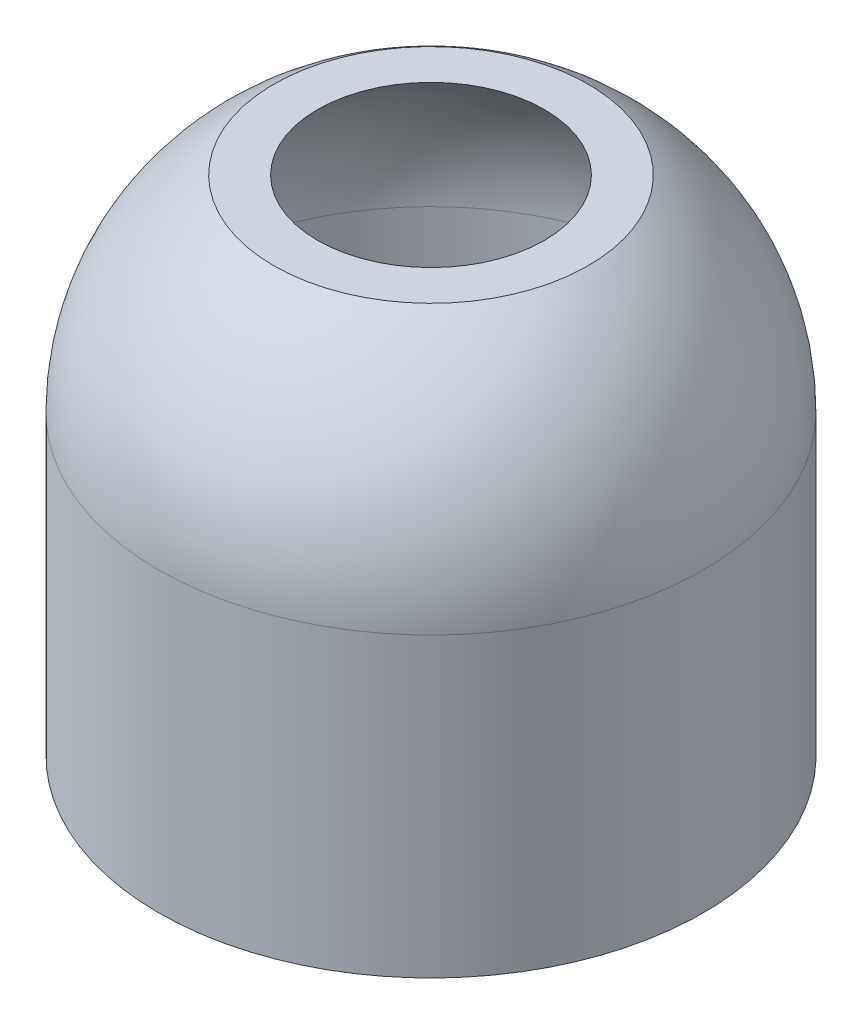
ISO-10303-21;
HEADER;
FILE_DESCRIPTION(('STEP AP214'),'2;1');
FILE_NAME('part.step','',(''),(''),'','','');
FILE_SCHEMA(('AUTOMOTIVE_DESIGN { 1 0 10303 214 1 1 1 1 }'));
ENDSEC;
DATA;
#1=APPLICATION_CONTEXT('core data for automotive mechanical design processes');
#2=APPLICATION_PROTOCOL_DEFINITION('international standard','automotive_design',2000,#1);
#3=PRODUCT_CONTEXT('',#1,'mechanical');
#4=PRODUCT('Part','Part','',(#3));
#5=PRODUCT_RELATED_PRODUCT_CATEGORY('part','',(#4));
#6=PRODUCT_DEFINITION_FORMATION('','',#4);
#7=PRODUCT_DEFINITION_CONTEXT('part definition',#1,'design');
#8=PRODUCT_DEFINITION('design','',#6,#7);
#9=PRODUCT_DEFINITION_SHAPE('','',#8);
#10=(LENGTH_UNIT() NAMED_UNIT(*) SI_UNIT(.MILLI.,.METRE.));
#11=(NAMED_UNIT(*) PLANE_ANGLE_UNIT() SI_UNIT($,.RADIAN.));
#12=(NAMED_UNIT(*) SI_UNIT($,.STERADIAN.) SOLID_ANGLE_UNIT());
#13=UNCERTAINTY_MEASURE_WITH_UNIT(LENGTH_MEASURE(1.E-05),#10,'distance_accuracy_value','');
#14=(GEOMETRIC_REPRESENTATION_CONTEXT(3) GLOBAL_UNCERTAINTY_ASSIGNED_CONTEXT((#13)) GLOBAL_UNIT_ASSIGNED_CONTEXT((#10,
#11,#12)) REPRESENTATION_CONTEXT('',''));
#15=CARTESIAN_POINT('',(0.,0.,0.));
#16=DIRECTION('',(0.,0.,1.));
#17=DIRECTION('',(1.,0.,0.));
#18=AXIS2_PLACEMENT_3D('',#15,#16,#17);
#19=CARTESIAN_POINT('',(27.5,0.,0.));
#20=DIRECTION('',(0.,1.,0.));
#21=DIRECTION('',(0.,0.,1.));
#22=AXIS2_PLACEMENT_3D('',#19,#20,#21);
#23=PLANE('',#22);
#24=CARTESIAN_POINT('',(0.,0.,0.));
#25=DIRECTION('',(0.,1.,0.));
#26=DIRECTION('',(0.,0.,1.));
#27=AXIS2_PLACEMENT_3D('',#24,#25,#26);
#28=CIRCLE('',#27,27.5);
#29=CARTESIAN_POINT('',(0.,0.,27.5));
#30=VERTEX_POINT('',#29);
#31=EDGE_CURVE('E10',#30,#30,#28,.T.);
#32=ORIENTED_EDGE('',*,*,#31,.F.);
#33=EDGE_LOOP('',(#32));
#34=FACE_BOUND('',#33,.T.);
#35=CARTESIAN_POINT('',(0.,0.,0.));
#36=DIRECTION('',(0.,1.,0.));
#37=DIRECTION('',(0.,0.,1.));
#38=AXIS2_PLACEMENT_3D('',#35,#36,#37);
#39=CIRCLE('',#38,25.5);
#40=CARTESIAN_POINT('',(0.,0.,25.5));
#41=VERTEX_POINT('',#40);
#42=EDGE_CURVE('E64',#41,#41,#39,.T.);
#43=ORIENTED_EDGE('',*,*,#42,.T.);
#44=EDGE_LOOP('',(#43));
#45=FACE_BOUND('',#44,.T.);
#46=ADVANCED_FACE('F37',(#34,#45),#23,.F.);
#47=CARTESIAN_POINT('',(0.,50.3698979591837,0.));
#48=DIRECTION('',(0.,1.,0.));
#49=DIRECTION('',(0.,0.,1.));
#50=AXIS2_PLACEMENT_3D('',#47,#48,#49);
#51=CYLINDRICAL_SURFACE('',#50,27.5);
#52=CARTESIAN_POINT('',(0.,30.,0.));
#53=DIRECTION('',(0.,1.,0.));
#54=DIRECTION('',(0.,0.,1.));
#55=AXIS2_PLACEMENT_3D('',#52,#53,#54);
#56=CIRCLE('',#55,27.5);
#57=CARTESIAN_POINT('',(0.,30.,27.5));
#58=VERTEX_POINT('',#57);
#59=EDGE_CURVE('E44',#58,#58,#56,.T.);
#60=ORIENTED_EDGE('',*,*,#59,.F.);
#61=EDGE_LOOP('',(#60));
#62=FACE_BOUND('',#61,.T.);
#63=ORIENTED_EDGE('',*,*,#31,.T.);
#64=EDGE_LOOP('',(#63));
#65=FACE_BOUND('',#64,.T.);
#66=ADVANCED_FACE('F90',(#62,#65),#51,.T.);
#67=CARTESIAN_POINT('',(0.,30.,0.));
#68=DIRECTION('',(0.,1.,0.));
#69=DIRECTION('',(0.,0.,1.));
#70=AXIS2_PLACEMENT_3D('',#67,#68,#69);
#71=DEGENERATE_TOROIDAL_SURFACE('',#70,3.07382099827883,24.4261790017212,.T.);
#72=CARTESIAN_POINT('',(0.,50.8,0.));
#73=DIRECTION('',(0.,1.,0.));
#74=DIRECTION('',(0.,0.,1.));
#75=AXIS2_PLACEMENT_3D('',#72,#73,#74);
#76=CIRCLE('',#75,15.88);
#77=CARTESIAN_POINT('',(0.,50.8,15.88));
#78=VERTEX_POINT('',#77);
#79=EDGE_CURVE('E49',#78,#78,#76,.T.);
#80=ORIENTED_EDGE('',*,*,#79,.F.);
#81=EDGE_LOOP('',(#80));
#82=FACE_BOUND('',#81,.T.);
#83=ORIENTED_EDGE('',*,*,#59,.T.);
#84=EDGE_LOOP('',(#83));
#85=FACE_BOUND('',#84,.T.);
#86=ADVANCED_FACE('F85',(#82,#85),#71,.T.);
#87=CARTESIAN_POINT('',(15.88,50.8,0.));
#88=DIRECTION('',(0.,-1.,0.));
#89=DIRECTION('',(0.,0.,-1.));
#90=AXIS2_PLACEMENT_3D('',#87,#88,#89);
#91=PLANE('',#90);
#92=CARTESIAN_POINT('',(0.,50.8,0.));
#93=DIRECTION('',(0.,1.,0.));
#94=DIRECTION('',(0.,0.,1.));
#95=AXIS2_PLACEMENT_3D('',#92,#93,#94);
#96=CIRCLE('',#95,11.4579431716038);
#97=CARTESIAN_POINT('',(0.,50.8,11.4579431716038));
#98=VERTEX_POINT('',#97);
#99=EDGE_CURVE('E54',#98,#98,#96,.T.);
#100=ORIENTED_EDGE('',*,*,#99,.F.);
#101=EDGE_LOOP('',(#100));
#102=FACE_BOUND('',#101,.T.);
#103=ORIENTED_EDGE('',*,*,#79,.T.);
#104=EDGE_LOOP('',(#103));
#105=FACE_BOUND('',#104,.T.);
#106=ADVANCED_FACE('F79',(#102,#105),#91,.F.);
#107=CARTESIAN_POINT('',(0.,30.,0.));
#108=DIRECTION('',(0.,1.,0.));
#109=DIRECTION('',(0.,0.,1.));
#110=AXIS2_PLACEMENT_3D('',#107,#108,#109);
#111=DEGENERATE_TOROIDAL_SURFACE('',#110,3.07382099827883,22.4261790017212,.T.);
#112=CARTESIAN_POINT('',(0.,30.,0.));
#113=DIRECTION('',(0.,1.,0.));
#114=DIRECTION('',(0.,0.,1.));
#115=AXIS2_PLACEMENT_3D('',#112,#113,#114);
#116=CIRCLE('',#115,25.5);
#117=CARTESIAN_POINT('',(0.,30.,25.5));
#118=VERTEX_POINT('',#117);
#119=EDGE_CURVE('E60',#118,#118,#116,.T.);
#120=ORIENTED_EDGE('',*,*,#119,.F.);
#121=EDGE_LOOP('',(#120));
#122=FACE_BOUND('',#121,.T.);
#123=ORIENTED_EDGE('',*,*,#99,.T.);
#124=EDGE_LOOP('',(#123));
#125=FACE_BOUND('',#124,.T.);
#126=ADVANCED_FACE('F73',(#122,#125),#111,.F.);
#127=CARTESIAN_POINT('',(0.,50.3698979591837,0.));
#128=DIRECTION('',(0.,1.,0.));
#129=DIRECTION('',(0.,0.,1.));
#130=AXIS2_PLACEMENT_3D('',#127,#128,#129);
#131=CYLINDRICAL_SURFACE('',#130,25.5);
#132=ORIENTED_EDGE('',*,*,#42,.F.);
#133=EDGE_LOOP('',(#132));
#134=FACE_BOUND('',#133,.T.);
#135=ORIENTED_EDGE('',*,*,#119,.T.);
#136=EDGE_LOOP('',(#135));
#137=FACE_BOUND('',#136,.T.);
#138=ADVANCED_FACE('F70',(#134,#137),#131,.F.);
#139=CLOSED_SHELL('',(#46,#66,#86,#106,#126,#138));
#140=MANIFOLD_SOLID_BREP('B2',#139);
#141=ADVANCED_BREP_SHAPE_REPRESENTATION('',(#18,#140),#14);
#142=SHAPE_DEFINITION_REPRESENTATION(#9,#141);
ENDSEC;
END-ISO-10303-21;
